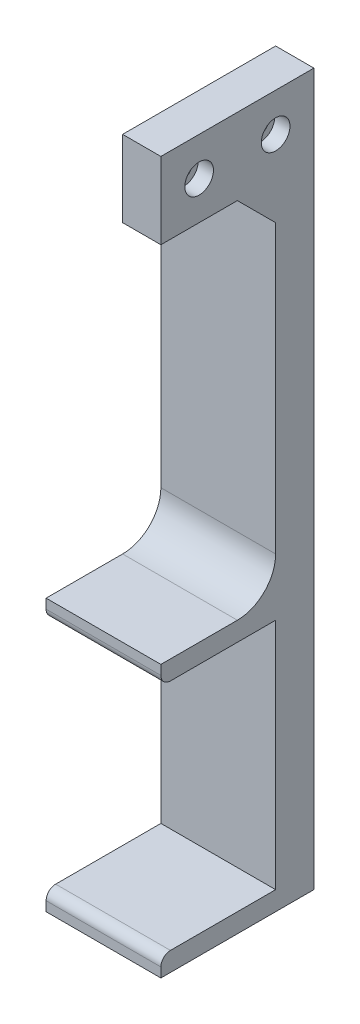
ISO-10303-21;
HEADER;
FILE_DESCRIPTION(('STEP AP214'),'2;1');
FILE_NAME('part.step','',(''),(''),'','','');
FILE_SCHEMA(('AUTOMOTIVE_DESIGN { 1 0 10303 214 1 1 1 1 }'));
ENDSEC;
DATA;
#1=APPLICATION_CONTEXT('core data for automotive mechanical design processes');
#2=APPLICATION_PROTOCOL_DEFINITION('international standard','automotive_design',2000,#1);
#3=PRODUCT_CONTEXT('',#1,'mechanical');
#4=PRODUCT('Part','Part','',(#3));
#5=PRODUCT_RELATED_PRODUCT_CATEGORY('part','',(#4));
#6=PRODUCT_DEFINITION_FORMATION('','',#4);
#7=PRODUCT_DEFINITION_CONTEXT('part definition',#1,'design');
#8=PRODUCT_DEFINITION('design','',#6,#7);
#9=PRODUCT_DEFINITION_SHAPE('','',#8);
#10=(LENGTH_UNIT() NAMED_UNIT(*) SI_UNIT(.MILLI.,.METRE.));
#11=(NAMED_UNIT(*) PLANE_ANGLE_UNIT() SI_UNIT($,.RADIAN.));
#12=(NAMED_UNIT(*) SI_UNIT($,.STERADIAN.) SOLID_ANGLE_UNIT());
#13=UNCERTAINTY_MEASURE_WITH_UNIT(LENGTH_MEASURE(1.E-05),#10,'distance_accuracy_value','');
#14=(GEOMETRIC_REPRESENTATION_CONTEXT(3) GLOBAL_UNCERTAINTY_ASSIGNED_CONTEXT((#13)) GLOBAL_UNIT_ASSIGNED_CONTEXT((#10,
#11,#12)) REPRESENTATION_CONTEXT('',''));
#15=CARTESIAN_POINT('',(0.,0.,0.));
#16=DIRECTION('',(0.,0.,1.));
#17=DIRECTION('',(1.,0.,0.));
#18=AXIS2_PLACEMENT_3D('',#15,#16,#17);
#19=CARTESIAN_POINT('',(18.2037007997491,150.330357142857,10.));
#20=DIRECTION('',(-1.,0.,0.));
#21=DIRECTION('',(0.,-1.,0.));
#22=AXIS2_PLACEMENT_3D('',#19,#20,#21);
#23=CYLINDRICAL_SURFACE('',#22,2.05);
#24=CARTESIAN_POINT('',(8.2037007997491,150.330357142857,10.));
#25=DIRECTION('',(-1.,0.,0.));
#26=DIRECTION('',(0.,-1.,0.));
#27=AXIS2_PLACEMENT_3D('',#24,#25,#26);
#28=CIRCLE('',#27,2.05);
#29=CARTESIAN_POINT('',(8.2037007997491,148.280357142857,10.));
#30=VERTEX_POINT('',#29);
#31=EDGE_CURVE('E339',#30,#30,#28,.T.);
#32=ORIENTED_EDGE('',*,*,#31,.T.);
#33=EDGE_LOOP('',(#32));
#34=FACE_BOUND('',#33,.T.);
#35=CARTESIAN_POINT('',(14.2037007997491,150.330357142857,10.));
#36=DIRECTION('',(1.,0.,0.));
#37=DIRECTION('',(0.,1.,0.));
#38=AXIS2_PLACEMENT_3D('',#35,#36,#37);
#39=CIRCLE('',#38,2.05);
#40=CARTESIAN_POINT('',(14.2037007997491,152.380357142857,10.));
#41=VERTEX_POINT('',#40);
#42=EDGE_CURVE('E43',#41,#41,#39,.F.);
#43=ORIENTED_EDGE('',*,*,#42,.F.);
#44=EDGE_LOOP('',(#43));
#45=FACE_BOUND('',#44,.T.);
#46=ADVANCED_FACE('F39',(#34,#45),#23,.F.);
#47=CARTESIAN_POINT('',(18.2037007997491,150.330357142857,30.));
#48=DIRECTION('',(-1.,0.,0.));
#49=DIRECTION('',(0.,-1.,0.));
#50=AXIS2_PLACEMENT_3D('',#47,#48,#49);
#51=CYLINDRICAL_SURFACE('',#50,2.05);
#52=CARTESIAN_POINT('',(8.2037007997491,150.330357142857,30.));
#53=DIRECTION('',(-1.,0.,0.));
#54=DIRECTION('',(0.,-1.,0.));
#55=AXIS2_PLACEMENT_3D('',#52,#53,#54);
#56=CIRCLE('',#55,2.05);
#57=CARTESIAN_POINT('',(8.2037007997491,148.280357142857,30.));
#58=VERTEX_POINT('',#57);
#59=EDGE_CURVE('E357',#58,#58,#56,.T.);
#60=ORIENTED_EDGE('',*,*,#59,.T.);
#61=EDGE_LOOP('',(#60));
#62=FACE_BOUND('',#61,.T.);
#63=CARTESIAN_POINT('',(14.2037007997491,150.330357142857,30.));
#64=DIRECTION('',(1.,0.,0.));
#65=DIRECTION('',(0.,1.,0.));
#66=AXIS2_PLACEMENT_3D('',#63,#64,#65);
#67=CIRCLE('',#66,2.05);
#68=CARTESIAN_POINT('',(14.2037007997491,152.380357142857,30.));
#69=VERTEX_POINT('',#68);
#70=EDGE_CURVE('E330',#69,#69,#67,.F.);
#71=ORIENTED_EDGE('',*,*,#70,.F.);
#72=EDGE_LOOP('',(#71));
#73=FACE_BOUND('',#72,.T.);
#74=ADVANCED_FACE('F432',(#62,#73),#51,.F.);
#75=CARTESIAN_POINT('',(0.,0.,10.));
#76=DIRECTION('',(0.,0.,1.));
#77=DIRECTION('',(1.,0.,0.));
#78=AXIS2_PLACEMENT_3D('',#75,#76,#77);
#79=PLANE('',#78);
#80=DIRECTION('',(0.,1.,0.));
#81=VECTOR('',#80,1.);
#82=CARTESIAN_POINT('',(18.2037007997491,160.330357142857,10.));
#83=LINE('',#82,#81);
#84=CARTESIAN_POINT('',(18.2037007997491,55.3303571428572,10.));
#85=VERTEX_POINT('',#84);
#86=CARTESIAN_POINT('',(18.2037007997491,130.330357142857,10.));
#87=VERTEX_POINT('',#86);
#88=EDGE_CURVE('E256',#85,#87,#83,.T.);
#89=ORIENTED_EDGE('',*,*,#88,.T.);
#90=DIRECTION('',(-1.,0.,0.));
#91=VECTOR('',#90,1.);
#92=CARTESIAN_POINT('',(1.2057980275635E-13,130.330357142857,10.));
#93=LINE('',#92,#91);
#94=CARTESIAN_POINT('',(-11.7962992002509,130.330357142857,10.));
#95=VERTEX_POINT('',#94);
#96=EDGE_CURVE('E63',#87,#95,#93,.T.);
#97=ORIENTED_EDGE('',*,*,#96,.T.);
#98=DIRECTION('',(0.,-1.,0.));
#99=VECTOR('',#98,1.);
#100=CARTESIAN_POINT('',(-11.7962992002509,160.330357142857,10.));
#101=LINE('',#100,#99);
#102=CARTESIAN_POINT('',(-11.7962992002509,55.3303571428572,10.));
#103=VERTEX_POINT('',#102);
#104=EDGE_CURVE('E253',#95,#103,#101,.T.);
#105=ORIENTED_EDGE('',*,*,#104,.T.);
#106=DIRECTION('',(-1.,0.,0.));
#107=VECTOR('',#106,1.);
#108=CARTESIAN_POINT('',(0.,55.3303571428571,10.));
#109=LINE('',#108,#107);
#110=EDGE_CURVE('E313',#103,#85,#109,.F.);
#111=ORIENTED_EDGE('',*,*,#110,.T.);
#112=EDGE_LOOP('',(#89,#97,#105,#111));
#113=FACE_BOUND('',#112,.T.);
#114=ADVANCED_FACE('F438',(#113),#79,.T.);
#115=CARTESIAN_POINT('',(18.2037007997491,-20.6696428571428,10.));
#116=VERTEX_POINT('',#115);
#117=CARTESIAN_POINT('',(18.2037007997491,40.3303571428571,10.));
#118=VERTEX_POINT('',#117);
#119=EDGE_CURVE('E258',#116,#118,#83,.T.);
#120=ORIENTED_EDGE('',*,*,#119,.T.);
#121=DIRECTION('',(1.,0.,0.));
#122=VECTOR('',#121,1.);
#123=CARTESIAN_POINT('',(-11.7962992002509,40.3303571428571,10.));
#124=LINE('',#123,#122);
#125=CARTESIAN_POINT('',(-11.7962992002509,40.3303571428571,10.));
#126=VERTEX_POINT('',#125);
#127=EDGE_CURVE('E198',#126,#118,#124,.T.);
#128=ORIENTED_EDGE('',*,*,#127,.F.);
#129=CARTESIAN_POINT('',(-11.7962992002509,-20.6696428571429,10.));
#130=VERTEX_POINT('',#129);
#131=EDGE_CURVE('E257',#126,#130,#101,.T.);
#132=ORIENTED_EDGE('',*,*,#131,.T.);
#133=DIRECTION('',(-1.,0.,0.));
#134=VECTOR('',#133,1.);
#135=CARTESIAN_POINT('',(-11.7962992002509,-20.6696428571429,10.));
#136=LINE('',#135,#134);
#137=EDGE_CURVE('E231',#116,#130,#136,.T.);
#138=ORIENTED_EDGE('',*,*,#137,.F.);
#139=EDGE_LOOP('',(#120,#128,#132,#138));
#140=FACE_BOUND('',#139,.T.);
#141=ADVANCED_FACE('F401',(#140),#79,.T.);
#142=CARTESIAN_POINT('',(-11.7962992002509,160.330357142857,10.));
#143=DIRECTION('',(1.,0.,0.));
#144=DIRECTION('',(0.,1.,0.));
#145=AXIS2_PLACEMENT_3D('',#142,#143,#144);
#146=PLANE('',#145);
#147=DIRECTION('',(0.,0.707106781186542,0.707106781186553));
#148=VECTOR('',#147,1.);
#149=CARTESIAN_POINT('',(-11.7962992002509,145.330357142857,25.));
#150=LINE('',#149,#148);
#151=CARTESIAN_POINT('',(-11.7962992002509,140.330357142857,20.0000000000001));
#152=VERTEX_POINT('',#151);
#153=EDGE_CURVE('E11',#95,#152,#150,.T.);
#154=ORIENTED_EDGE('',*,*,#153,.T.);
#155=DIRECTION('',(0.,0.,1.));
#156=VECTOR('',#155,1.);
#157=CARTESIAN_POINT('',(-11.7962992002509,140.330357142857,40.));
#158=LINE('',#157,#156);
#159=CARTESIAN_POINT('',(-11.7962992002509,140.330357142857,0.));
#160=VERTEX_POINT('',#159);
#161=EDGE_CURVE('E176',#160,#152,#158,.T.);
#162=ORIENTED_EDGE('',*,*,#161,.F.);
#163=DIRECTION('',(0.,-1.,0.));
#164=VECTOR('',#163,1.);
#165=CARTESIAN_POINT('',(-11.7962992002509,160.330357142857,0.));
#166=LINE('',#165,#164);
#167=CARTESIAN_POINT('',(-11.7962992002509,-25.6696428571429,0.));
#168=VERTEX_POINT('',#167);
#169=EDGE_CURVE('E252',#160,#168,#166,.T.);
#170=ORIENTED_EDGE('',*,*,#169,.T.);
#171=DIRECTION('',(0.,0.,-1.));
#172=VECTOR('',#171,1.);
#173=CARTESIAN_POINT('',(-11.7962992002509,-25.6696428571429,10.));
#174=LINE('',#173,#172);
#175=CARTESIAN_POINT('',(-11.7962992002509,-25.6696428571429,40.));
#176=VERTEX_POINT('',#175);
#177=EDGE_CURVE('E279',#176,#168,#174,.T.);
#178=ORIENTED_EDGE('',*,*,#177,.F.);
#179=DIRECTION('',(0.,-1.,0.));
#180=VECTOR('',#179,1.);
#181=CARTESIAN_POINT('',(-11.7962992002509,-25.6696428571429,40.));
#182=LINE('',#181,#180);
#183=CARTESIAN_POINT('',(-11.7962992002509,-23.1696428571429,40.));
#184=VERTEX_POINT('',#183);
#185=EDGE_CURVE('E232',#184,#176,#182,.T.);
#186=ORIENTED_EDGE('',*,*,#185,.F.);
#187=CARTESIAN_POINT('',(-11.7962992002509,-23.1696428571429,37.5));
#188=DIRECTION('',(1.,0.,0.));
#189=DIRECTION('',(0.,1.,0.));
#190=AXIS2_PLACEMENT_3D('',#187,#188,#189);
#191=CIRCLE('',#190,2.5);
#192=CARTESIAN_POINT('',(-11.7962992002509,-20.6696428571429,37.5));
#193=VERTEX_POINT('',#192);
#194=EDGE_CURVE('E290',#184,#193,#191,.F.);
#195=ORIENTED_EDGE('',*,*,#194,.T.);
#196=DIRECTION('',(0.,0.,-1.));
#197=VECTOR('',#196,1.);
#198=CARTESIAN_POINT('',(-11.7962992002509,-20.6696428571429,40.));
#199=LINE('',#198,#197);
#200=EDGE_CURVE('E243',#193,#130,#199,.T.);
#201=ORIENTED_EDGE('',*,*,#200,.T.);
#202=ORIENTED_EDGE('',*,*,#131,.F.);
#203=DIRECTION('',(0.,0.,-1.));
#204=VECTOR('',#203,1.);
#205=CARTESIAN_POINT('',(-11.7962992002509,40.3303571428571,40.));
#206=LINE('',#205,#204);
#207=CARTESIAN_POINT('',(-11.7962992002509,40.3303571428571,37.5));
#208=VERTEX_POINT('',#207);
#209=EDGE_CURVE('E228',#208,#126,#206,.T.);
#210=ORIENTED_EDGE('',*,*,#209,.F.);
#211=CARTESIAN_POINT('',(-11.7962992002509,42.8303571428571,37.5));
#212=DIRECTION('',(1.,0.,0.));
#213=DIRECTION('',(0.,1.,0.));
#214=AXIS2_PLACEMENT_3D('',#211,#212,#213);
#215=CIRCLE('',#214,2.5);
#216=CARTESIAN_POINT('',(-11.7962992002509,42.8303571428571,40.));
#217=VERTEX_POINT('',#216);
#218=EDGE_CURVE('E287',#208,#217,#215,.F.);
#219=ORIENTED_EDGE('',*,*,#218,.T.);
#220=DIRECTION('',(0.,-1.,0.));
#221=VECTOR('',#220,1.);
#222=CARTESIAN_POINT('',(-11.7962992002509,45.3303571428571,40.));
#223=LINE('',#222,#221);
#224=CARTESIAN_POINT('',(-11.7962992002509,45.3303571428571,40.));
#225=VERTEX_POINT('',#224);
#226=EDGE_CURVE('E204',#225,#217,#223,.T.);
#227=ORIENTED_EDGE('',*,*,#226,.F.);
#228=DIRECTION('',(0.,0.,-1.));
#229=VECTOR('',#228,1.);
#230=CARTESIAN_POINT('',(-11.7962992002509,45.3303571428571,40.));
#231=LINE('',#230,#229);
#232=CARTESIAN_POINT('',(-11.7962992002509,45.3303571428571,20.));
#233=VERTEX_POINT('',#232);
#234=EDGE_CURVE('E214',#225,#233,#231,.T.);
#235=ORIENTED_EDGE('',*,*,#234,.T.);
#236=CARTESIAN_POINT('',(-11.7962992002509,55.3303571428571,20.));
#237=DIRECTION('',(1.,0.,0.));
#238=DIRECTION('',(0.,1.,0.));
#239=AXIS2_PLACEMENT_3D('',#236,#237,#238);
#240=CIRCLE('',#239,10.);
#241=EDGE_CURVE('E316',#233,#103,#240,.T.);
#242=ORIENTED_EDGE('',*,*,#241,.T.);
#243=ORIENTED_EDGE('',*,*,#104,.F.);
#244=EDGE_LOOP('',(#154,#162,#170,#178,#186,#195,#201,#202,#210,#219,#227,#235,#242,#243));
#245=FACE_BOUND('',#244,.T.);
#246=ADVANCED_FACE('F418',(#245),#146,.F.);
#247=CARTESIAN_POINT('',(-11.7962992002509,-25.6696428571429,10.));
#248=DIRECTION('',(0.,1.,0.));
#249=DIRECTION('',(0.,0.,1.));
#250=AXIS2_PLACEMENT_3D('',#247,#248,#249);
#251=PLANE('',#250);
#252=DIRECTION('',(1.,0.,0.));
#253=VECTOR('',#252,1.);
#254=CARTESIAN_POINT('',(-11.7962992002509,-25.6696428571429,0.));
#255=LINE('',#254,#253);
#256=CARTESIAN_POINT('',(18.2037007997491,-25.6696428571429,0.));
#257=VERTEX_POINT('',#256);
#258=EDGE_CURVE('E265',#168,#257,#255,.T.);
#259=ORIENTED_EDGE('',*,*,#258,.T.);
#260=DIRECTION('',(0.,0.,-1.));
#261=VECTOR('',#260,1.);
#262=CARTESIAN_POINT('',(18.2037007997491,-25.6696428571429,10.));
#263=LINE('',#262,#261);
#264=CARTESIAN_POINT('',(18.2037007997491,-25.6696428571429,40.));
#265=VERTEX_POINT('',#264);
#266=EDGE_CURVE('E275',#265,#257,#263,.T.);
#267=ORIENTED_EDGE('',*,*,#266,.F.);
#268=DIRECTION('',(1.,0.,0.));
#269=VECTOR('',#268,1.);
#270=CARTESIAN_POINT('',(-11.7962992002509,-25.6696428571429,40.));
#271=LINE('',#270,#269);
#272=EDGE_CURVE('E235',#176,#265,#271,.T.);
#273=ORIENTED_EDGE('',*,*,#272,.F.);
#274=ORIENTED_EDGE('',*,*,#177,.T.);
#275=EDGE_LOOP('',(#259,#267,#273,#274));
#276=FACE_BOUND('',#275,.T.);
#277=ADVANCED_FACE('F421',(#276),#251,.F.);
#278=CARTESIAN_POINT('',(18.2037007997491,160.330357142857,10.));
#279=DIRECTION('',(-1.,0.,0.));
#280=DIRECTION('',(0.,-1.,0.));
#281=AXIS2_PLACEMENT_3D('',#278,#279,#280);
#282=PLANE('',#281);
#283=CARTESIAN_POINT('',(18.2037007997491,150.330357142857,30.));
#284=DIRECTION('',(1.,0.,0.));
#285=DIRECTION('',(0.,1.,0.));
#286=AXIS2_PLACEMENT_3D('',#283,#284,#285);
#287=CIRCLE('',#286,3.75);
#288=CARTESIAN_POINT('',(18.2037007997491,154.080357142857,30.));
#289=VERTEX_POINT('',#288);
#290=EDGE_CURVE('E341',#289,#289,#287,.T.);
#291=ORIENTED_EDGE('',*,*,#290,.F.);
#292=EDGE_LOOP('',(#291));
#293=FACE_BOUND('',#292,.T.);
#294=CARTESIAN_POINT('',(18.2037007997491,150.330357142857,10.));
#295=DIRECTION('',(1.,0.,0.));
#296=DIRECTION('',(0.,1.,0.));
#297=AXIS2_PLACEMENT_3D('',#294,#295,#296);
#298=CIRCLE('',#297,3.75);
#299=CARTESIAN_POINT('',(18.2037007997491,154.080357142857,10.));
#300=VERTEX_POINT('',#299);
#301=EDGE_CURVE('E353',#300,#300,#298,.T.);
#302=ORIENTED_EDGE('',*,*,#301,.F.);
#303=EDGE_LOOP('',(#302));
#304=FACE_BOUND('',#303,.T.);
#305=DIRECTION('',(0.,0.,-1.));
#306=VECTOR('',#305,1.);
#307=CARTESIAN_POINT('',(18.2037007997491,-20.6696428571429,40.));
#308=LINE('',#307,#306);
#309=CARTESIAN_POINT('',(18.2037007997491,-20.6696428571429,37.5));
#310=VERTEX_POINT('',#309);
#311=EDGE_CURVE('E249',#310,#116,#308,.T.);
#312=ORIENTED_EDGE('',*,*,#311,.F.);
#313=CARTESIAN_POINT('',(18.2037007997491,-23.1696428571429,37.5));
#314=DIRECTION('',(-1.,0.,0.));
#315=DIRECTION('',(0.,-1.,0.));
#316=AXIS2_PLACEMENT_3D('',#313,#314,#315);
#317=CIRCLE('',#316,2.5);
#318=CARTESIAN_POINT('',(18.2037007997491,-23.1696428571429,40.));
#319=VERTEX_POINT('',#318);
#320=EDGE_CURVE('E299',#310,#319,#317,.F.);
#321=ORIENTED_EDGE('',*,*,#320,.T.);
#322=DIRECTION('',(0.,1.,0.));
#323=VECTOR('',#322,1.);
#324=CARTESIAN_POINT('',(18.2037007997491,-25.6696428571429,40.));
#325=LINE('',#324,#323);
#326=EDGE_CURVE('E239',#265,#319,#325,.T.);
#327=ORIENTED_EDGE('',*,*,#326,.F.);
#328=ORIENTED_EDGE('',*,*,#266,.T.);
#329=DIRECTION('',(0.,1.,0.));
#330=VECTOR('',#329,1.);
#331=CARTESIAN_POINT('',(18.2037007997491,160.330357142857,0.));
#332=LINE('',#331,#330);
#333=CARTESIAN_POINT('',(18.2037007997491,160.330357142857,0.));
#334=VERTEX_POINT('',#333);
#335=EDGE_CURVE('E268',#257,#334,#332,.T.);
#336=ORIENTED_EDGE('',*,*,#335,.T.);
#337=DIRECTION('',(0.,0.,-1.));
#338=VECTOR('',#337,1.);
#339=CARTESIAN_POINT('',(18.2037007997491,160.330357142857,10.));
#340=LINE('',#339,#338);
#341=CARTESIAN_POINT('',(18.2037007997491,160.330357142857,40.));
#342=VERTEX_POINT('',#341);
#343=EDGE_CURVE('E262',#342,#334,#340,.T.);
#344=ORIENTED_EDGE('',*,*,#343,.F.);
#345=DIRECTION('',(0.,1.,0.));
#346=VECTOR('',#345,1.);
#347=CARTESIAN_POINT('',(18.2037007997491,160.330357142857,40.));
#348=LINE('',#347,#346);
#349=CARTESIAN_POINT('',(18.2037007997491,140.330357142857,40.));
#350=VERTEX_POINT('',#349);
#351=EDGE_CURVE('E192',#350,#342,#348,.T.);
#352=ORIENTED_EDGE('',*,*,#351,.F.);
#353=DIRECTION('',(0.,0.,-1.));
#354=VECTOR('',#353,1.);
#355=CARTESIAN_POINT('',(18.2037007997491,140.330357142857,40.));
#356=LINE('',#355,#354);
#357=CARTESIAN_POINT('',(18.2037007997491,140.330357142857,20.0000000000001));
#358=VERTEX_POINT('',#357);
#359=EDGE_CURVE('E194',#350,#358,#356,.T.);
#360=ORIENTED_EDGE('',*,*,#359,.T.);
#361=DIRECTION('',(0.,-0.707106781186542,-0.707106781186553));
#362=VECTOR('',#361,1.);
#363=CARTESIAN_POINT('',(18.2037007997491,145.330357142857,25.));
#364=LINE('',#363,#362);
#365=EDGE_CURVE('E49',#358,#87,#364,.T.);
#366=ORIENTED_EDGE('',*,*,#365,.T.);
#367=ORIENTED_EDGE('',*,*,#88,.F.);
#368=CARTESIAN_POINT('',(18.2037007997491,55.3303571428571,20.));
#369=DIRECTION('',(-1.,0.,0.));
#370=DIRECTION('',(0.,-1.,0.));
#371=AXIS2_PLACEMENT_3D('',#368,#369,#370);
#372=CIRCLE('',#371,10.);
#373=CARTESIAN_POINT('',(18.2037007997491,45.3303571428571,20.));
#374=VERTEX_POINT('',#373);
#375=EDGE_CURVE('E320',#85,#374,#372,.T.);
#376=ORIENTED_EDGE('',*,*,#375,.T.);
#377=DIRECTION('',(0.,0.,-1.));
#378=VECTOR('',#377,1.);
#379=CARTESIAN_POINT('',(18.2037007997491,45.3303571428571,40.));
#380=LINE('',#379,#378);
#381=CARTESIAN_POINT('',(18.2037007997491,45.3303571428571,40.));
#382=VERTEX_POINT('',#381);
#383=EDGE_CURVE('E221',#382,#374,#380,.T.);
#384=ORIENTED_EDGE('',*,*,#383,.F.);
#385=DIRECTION('',(0.,1.,0.));
#386=VECTOR('',#385,1.);
#387=CARTESIAN_POINT('',(18.2037007997491,45.3303571428571,40.));
#388=LINE('',#387,#386);
#389=CARTESIAN_POINT('',(18.2037007997491,42.8303571428571,40.));
#390=VERTEX_POINT('',#389);
#391=EDGE_CURVE('E208',#390,#382,#388,.T.);
#392=ORIENTED_EDGE('',*,*,#391,.F.);
#393=CARTESIAN_POINT('',(18.2037007997491,42.8303571428571,37.5));
#394=DIRECTION('',(-1.,0.,0.));
#395=DIRECTION('',(0.,-1.,0.));
#396=AXIS2_PLACEMENT_3D('',#393,#394,#395);
#397=CIRCLE('',#396,2.5);
#398=CARTESIAN_POINT('',(18.2037007997491,40.3303571428571,37.5));
#399=VERTEX_POINT('',#398);
#400=EDGE_CURVE('E296',#390,#399,#397,.F.);
#401=ORIENTED_EDGE('',*,*,#400,.T.);
#402=DIRECTION('',(0.,0.,-1.));
#403=VECTOR('',#402,1.);
#404=CARTESIAN_POINT('',(18.2037007997491,40.3303571428571,40.));
#405=LINE('',#404,#403);
#406=EDGE_CURVE('E225',#399,#118,#405,.T.);
#407=ORIENTED_EDGE('',*,*,#406,.T.);
#408=ORIENTED_EDGE('',*,*,#119,.F.);
#409=EDGE_LOOP('',(#312,#321,#327,#328,#336,#344,#352,#360,#366,#367,#376,#384,#392,#401,#407,#408));
#410=FACE_BOUND('',#409,.T.);
#411=ADVANCED_FACE('F379',(#293,#304,#410),#282,.F.);
#412=CARTESIAN_POINT('',(-11.7962992002509,160.330357142857,10.));
#413=DIRECTION('',(0.,-1.,0.));
#414=DIRECTION('',(0.,0.,-1.));
#415=AXIS2_PLACEMENT_3D('',#412,#413,#414);
#416=PLANE('',#415);
#417=DIRECTION('',(-1.,0.,0.));
#418=VECTOR('',#417,1.);
#419=CARTESIAN_POINT('',(-11.7962992002509,160.330357142857,0.));
#420=LINE('',#419,#418);
#421=CARTESIAN_POINT('',(8.20370079974908,160.330357142857,0.));
#422=VERTEX_POINT('',#421);
#423=EDGE_CURVE('E185',#334,#422,#420,.T.);
#424=ORIENTED_EDGE('',*,*,#423,.T.);
#425=DIRECTION('',(0.,0.,-1.));
#426=VECTOR('',#425,1.);
#427=CARTESIAN_POINT('',(8.20370079974908,160.330357142857,40.));
#428=LINE('',#427,#426);
#429=CARTESIAN_POINT('',(8.20370079974908,160.330357142857,40.));
#430=VERTEX_POINT('',#429);
#431=EDGE_CURVE('E167',#430,#422,#428,.T.);
#432=ORIENTED_EDGE('',*,*,#431,.F.);
#433=DIRECTION('',(-1.,0.,0.));
#434=VECTOR('',#433,1.);
#435=CARTESIAN_POINT('',(-11.7962992002509,160.330357142857,40.));
#436=LINE('',#435,#434);
#437=EDGE_CURVE('E183',#342,#430,#436,.T.);
#438=ORIENTED_EDGE('',*,*,#437,.F.);
#439=ORIENTED_EDGE('',*,*,#343,.T.);
#440=EDGE_LOOP('',(#424,#432,#438,#439));
#441=FACE_BOUND('',#440,.T.);
#442=ADVANCED_FACE('F181',(#441),#416,.F.);
#443=CARTESIAN_POINT('',(0.,0.,0.));
#444=DIRECTION('',(0.,0.,1.));
#445=DIRECTION('',(1.,0.,0.));
#446=AXIS2_PLACEMENT_3D('',#443,#444,#445);
#447=PLANE('',#446);
#448=ORIENTED_EDGE('',*,*,#169,.F.);
#449=DIRECTION('',(-1.,0.,0.));
#450=VECTOR('',#449,1.);
#451=CARTESIAN_POINT('',(8.20370079974909,140.330357142857,0.));
#452=LINE('',#451,#450);
#453=CARTESIAN_POINT('',(8.20370079974909,140.330357142857,0.));
#454=VERTEX_POINT('',#453);
#455=EDGE_CURVE('E369',#454,#160,#452,.T.);
#456=ORIENTED_EDGE('',*,*,#455,.F.);
#457=DIRECTION('',(0.,-1.,0.));
#458=VECTOR('',#457,1.);
#459=CARTESIAN_POINT('',(8.20370079974908,160.330357142857,0.));
#460=LINE('',#459,#458);
#461=EDGE_CURVE('E187',#422,#454,#460,.T.);
#462=ORIENTED_EDGE('',*,*,#461,.F.);
#463=ORIENTED_EDGE('',*,*,#423,.F.);
#464=ORIENTED_EDGE('',*,*,#335,.F.);
#465=ORIENTED_EDGE('',*,*,#258,.F.);
#466=EDGE_LOOP('',(#448,#456,#462,#463,#464,#465));
#467=FACE_BOUND('',#466,.T.);
#468=ADVANCED_FACE('F383',(#467),#447,.F.);
#469=CARTESIAN_POINT('',(-11.7962992002509,-20.6696428571429,40.));
#470=DIRECTION('',(0.,-1.,0.));
#471=DIRECTION('',(0.,0.,-1.));
#472=AXIS2_PLACEMENT_3D('',#469,#470,#471);
#473=PLANE('',#472);
#474=ORIENTED_EDGE('',*,*,#200,.F.);
#475=DIRECTION('',(-1.,0.,0.));
#476=VECTOR('',#475,1.);
#477=CARTESIAN_POINT('',(-11.7962992002509,-20.6696428571429,37.5));
#478=LINE('',#477,#476);
#479=EDGE_CURVE('E293',#193,#310,#478,.F.);
#480=ORIENTED_EDGE('',*,*,#479,.T.);
#481=ORIENTED_EDGE('',*,*,#311,.T.);
#482=ORIENTED_EDGE('',*,*,#137,.T.);
#483=EDGE_LOOP('',(#474,#480,#481,#482));
#484=FACE_BOUND('',#483,.T.);
#485=ADVANCED_FACE('F407',(#484),#473,.F.);
#486=CARTESIAN_POINT('',(0.,0.,40.));
#487=DIRECTION('',(0.,0.,-1.));
#488=DIRECTION('',(-1.,0.,0.));
#489=AXIS2_PLACEMENT_3D('',#486,#487,#488);
#490=PLANE('',#489);
#491=ORIENTED_EDGE('',*,*,#326,.T.);
#492=DIRECTION('',(-1.,0.,0.));
#493=VECTOR('',#492,1.);
#494=CARTESIAN_POINT('',(0.,-23.1696428571429,40.));
#495=LINE('',#494,#493);
#496=EDGE_CURVE('E283',#319,#184,#495,.T.);
#497=ORIENTED_EDGE('',*,*,#496,.T.);
#498=ORIENTED_EDGE('',*,*,#185,.T.);
#499=ORIENTED_EDGE('',*,*,#272,.T.);
#500=EDGE_LOOP('',(#491,#497,#498,#499));
#501=FACE_BOUND('',#500,.T.);
#502=ADVANCED_FACE('F416',(#501),#490,.F.);
#503=CARTESIAN_POINT('',(-11.7962992002509,40.3303571428571,40.));
#504=DIRECTION('',(0.,1.,0.));
#505=DIRECTION('',(0.,0.,1.));
#506=AXIS2_PLACEMENT_3D('',#503,#504,#505);
#507=PLANE('',#506);
#508=ORIENTED_EDGE('',*,*,#406,.F.);
#509=DIRECTION('',(1.,0.,0.));
#510=VECTOR('',#509,1.);
#511=CARTESIAN_POINT('',(-11.7962992002509,40.3303571428571,37.5));
#512=LINE('',#511,#510);
#513=EDGE_CURVE('E306',#399,#208,#512,.F.);
#514=ORIENTED_EDGE('',*,*,#513,.T.);
#515=ORIENTED_EDGE('',*,*,#209,.T.);
#516=ORIENTED_EDGE('',*,*,#127,.T.);
#517=EDGE_LOOP('',(#508,#514,#515,#516));
#518=FACE_BOUND('',#517,.T.);
#519=ADVANCED_FACE('F461',(#518),#507,.F.);
#520=CARTESIAN_POINT('',(-11.7962992002509,45.3303571428571,40.));
#521=DIRECTION('',(0.,-1.,0.));
#522=DIRECTION('',(0.,0.,-1.));
#523=AXIS2_PLACEMENT_3D('',#520,#521,#522);
#524=PLANE('',#523);
#525=ORIENTED_EDGE('',*,*,#383,.T.);
#526=DIRECTION('',(-1.,0.,0.));
#527=VECTOR('',#526,1.);
#528=CARTESIAN_POINT('',(-11.7962992002509,45.3303571428571,20.));
#529=LINE('',#528,#527);
#530=EDGE_CURVE('E309',#374,#233,#529,.T.);
#531=ORIENTED_EDGE('',*,*,#530,.T.);
#532=ORIENTED_EDGE('',*,*,#234,.F.);
#533=DIRECTION('',(-1.,0.,0.));
#534=VECTOR('',#533,1.);
#535=CARTESIAN_POINT('',(-11.7962992002509,45.3303571428571,40.));
#536=LINE('',#535,#534);
#537=EDGE_CURVE('E211',#382,#225,#536,.T.);
#538=ORIENTED_EDGE('',*,*,#537,.F.);
#539=EDGE_LOOP('',(#525,#531,#532,#538));
#540=FACE_BOUND('',#539,.T.);
#541=ADVANCED_FACE('F457',(#540),#524,.F.);
#542=CARTESIAN_POINT('',(0.,0.,40.));
#543=DIRECTION('',(0.,0.,1.));
#544=DIRECTION('',(1.,0.,0.));
#545=AXIS2_PLACEMENT_3D('',#542,#543,#544);
#546=PLANE('',#545);
#547=ORIENTED_EDGE('',*,*,#226,.T.);
#548=DIRECTION('',(1.,0.,0.));
#549=VECTOR('',#548,1.);
#550=CARTESIAN_POINT('',(18.2037007997491,42.8303571428571,40.));
#551=LINE('',#550,#549);
#552=EDGE_CURVE('E302',#217,#390,#551,.T.);
#553=ORIENTED_EDGE('',*,*,#552,.T.);
#554=ORIENTED_EDGE('',*,*,#391,.T.);
#555=ORIENTED_EDGE('',*,*,#537,.T.);
#556=EDGE_LOOP('',(#547,#553,#554,#555));
#557=FACE_BOUND('',#556,.T.);
#558=ADVANCED_FACE('F454',(#557),#546,.T.);
#559=CARTESIAN_POINT('',(-11.7962992002509,140.330357142857,40.));
#560=DIRECTION('',(0.,1.,0.));
#561=DIRECTION('',(-1.,0.,0.));
#562=AXIS2_PLACEMENT_3D('',#559,#560,#561);
#563=PLANE('',#562);
#564=DIRECTION('',(1.,0.,0.));
#565=VECTOR('',#564,1.);
#566=CARTESIAN_POINT('',(-11.7962992002509,140.330357142857,40.));
#567=LINE('',#566,#565);
#568=CARTESIAN_POINT('',(8.20370079974909,140.330357142857,40.));
#569=VERTEX_POINT('',#568);
#570=EDGE_CURVE('E200',#569,#350,#567,.T.);
#571=ORIENTED_EDGE('',*,*,#570,.F.);
#572=DIRECTION('',(0.,0.,1.));
#573=VECTOR('',#572,1.);
#574=CARTESIAN_POINT('',(8.20370079974909,140.330357142857,40.));
#575=LINE('',#574,#573);
#576=CARTESIAN_POINT('',(8.20370079974909,140.330357142857,20.0000000000001));
#577=VERTEX_POINT('',#576);
#578=EDGE_CURVE('E171',#577,#569,#575,.T.);
#579=ORIENTED_EDGE('',*,*,#578,.F.);
#580=DIRECTION('',(1.,0.,0.));
#581=VECTOR('',#580,1.);
#582=CARTESIAN_POINT('',(-11.7962992002509,140.330357142857,20.0000000000001));
#583=LINE('',#582,#581);
#584=EDGE_CURVE('E323',#577,#358,#583,.T.);
#585=ORIENTED_EDGE('',*,*,#584,.T.);
#586=ORIENTED_EDGE('',*,*,#359,.F.);
#587=EDGE_LOOP('',(#571,#579,#585,#586));
#588=FACE_BOUND('',#587,.T.);
#589=ADVANCED_FACE('F376',(#588),#563,.F.);
#590=CARTESIAN_POINT('',(0.,0.,40.));
#591=DIRECTION('',(0.,0.,1.));
#592=DIRECTION('',(1.,0.,0.));
#593=AXIS2_PLACEMENT_3D('',#590,#591,#592);
#594=PLANE('',#593);
#595=DIRECTION('',(0.,1.,0.));
#596=VECTOR('',#595,1.);
#597=CARTESIAN_POINT('',(8.20370079974908,160.330357142857,40.));
#598=LINE('',#597,#596);
#599=EDGE_CURVE('E164',#569,#430,#598,.T.);
#600=ORIENTED_EDGE('',*,*,#599,.F.);
#601=ORIENTED_EDGE('',*,*,#570,.T.);
#602=ORIENTED_EDGE('',*,*,#351,.T.);
#603=ORIENTED_EDGE('',*,*,#437,.T.);
#604=EDGE_LOOP('',(#600,#601,#602,#603));
#605=FACE_BOUND('',#604,.T.);
#606=ADVANCED_FACE('F190',(#605),#594,.T.);
#607=CARTESIAN_POINT('',(0.,-23.1696428571429,37.5));
#608=DIRECTION('',(-1.,0.,0.));
#609=DIRECTION('',(0.,0.,1.));
#610=AXIS2_PLACEMENT_3D('',#607,#608,#609);
#611=CYLINDRICAL_SURFACE('',#610,2.5);
#612=ORIENTED_EDGE('',*,*,#320,.F.);
#613=ORIENTED_EDGE('',*,*,#479,.F.);
#614=ORIENTED_EDGE('',*,*,#194,.F.);
#615=ORIENTED_EDGE('',*,*,#496,.F.);
#616=EDGE_LOOP('',(#612,#613,#614,#615));
#617=FACE_BOUND('',#616,.T.);
#618=ADVANCED_FACE('F413',(#617),#611,.T.);
#619=CARTESIAN_POINT('',(0.,42.8303571428571,37.5));
#620=DIRECTION('',(-1.,0.,0.));
#621=DIRECTION('',(0.,0.,1.));
#622=AXIS2_PLACEMENT_3D('',#619,#620,#621);
#623=CYLINDRICAL_SURFACE('',#622,2.5);
#624=ORIENTED_EDGE('',*,*,#218,.F.);
#625=ORIENTED_EDGE('',*,*,#513,.F.);
#626=ORIENTED_EDGE('',*,*,#400,.F.);
#627=ORIENTED_EDGE('',*,*,#552,.F.);
#628=EDGE_LOOP('',(#624,#625,#626,#627));
#629=FACE_BOUND('',#628,.T.);
#630=ADVANCED_FACE('F521',(#629),#623,.T.);
#631=CARTESIAN_POINT('',(-11.7962992002509,55.3303571428571,20.));
#632=DIRECTION('',(-1.,0.,0.));
#633=DIRECTION('',(0.,0.,1.));
#634=AXIS2_PLACEMENT_3D('',#631,#632,#633);
#635=CYLINDRICAL_SURFACE('',#634,10.);
#636=ORIENTED_EDGE('',*,*,#375,.F.);
#637=ORIENTED_EDGE('',*,*,#110,.F.);
#638=ORIENTED_EDGE('',*,*,#241,.F.);
#639=ORIENTED_EDGE('',*,*,#530,.F.);
#640=EDGE_LOOP('',(#636,#637,#638,#639));
#641=FACE_BOUND('',#640,.T.);
#642=ADVANCED_FACE('F527',(#641),#635,.F.);
#643=CARTESIAN_POINT('',(-11.7962992002509,140.330357142857,20.0000000000001));
#644=DIRECTION('',(0.,0.707106781186553,-0.707106781186542));
#645=DIRECTION('',(1.,0.,0.));
#646=AXIS2_PLACEMENT_3D('',#643,#644,#645);
#647=PLANE('',#646);
#648=ORIENTED_EDGE('',*,*,#153,.F.);
#649=ORIENTED_EDGE('',*,*,#96,.F.);
#650=ORIENTED_EDGE('',*,*,#365,.F.);
#651=ORIENTED_EDGE('',*,*,#584,.F.);
#652=EDGE_CURVE('E324',#152,#577,#583,.T.);
#653=ORIENTED_EDGE('',*,*,#652,.F.);
#654=EDGE_LOOP('',(#648,#649,#650,#651,#653));
#655=FACE_BOUND('',#654,.T.);
#656=ADVANCED_FACE('F41',(#655),#647,.F.);
#657=CARTESIAN_POINT('',(8.20370079974909,140.330357142857,40.));
#658=DIRECTION('',(0.,-1.,0.));
#659=DIRECTION('',(1.,0.,0.));
#660=AXIS2_PLACEMENT_3D('',#657,#658,#659);
#661=PLANE('',#660);
#662=EDGE_CURVE('E366',#454,#577,#575,.T.);
#663=ORIENTED_EDGE('',*,*,#662,.F.);
#664=ORIENTED_EDGE('',*,*,#455,.T.);
#665=ORIENTED_EDGE('',*,*,#161,.T.);
#666=ORIENTED_EDGE('',*,*,#652,.T.);
#667=EDGE_LOOP('',(#663,#664,#665,#666));
#668=FACE_BOUND('',#667,.T.);
#669=ADVANCED_FACE('F388',(#668),#661,.F.);
#670=CARTESIAN_POINT('',(8.20370079974911,0.,0.));
#671=DIRECTION('',(1.,0.,0.));
#672=DIRECTION('',(0.,1.,0.));
#673=AXIS2_PLACEMENT_3D('',#670,#671,#672);
#674=PLANE('',#673);
#675=ORIENTED_EDGE('',*,*,#59,.F.);
#676=EDGE_LOOP('',(#675));
#677=FACE_BOUND('',#676,.T.);
#678=ORIENTED_EDGE('',*,*,#31,.F.);
#679=EDGE_LOOP('',(#678));
#680=FACE_BOUND('',#679,.T.);
#681=ORIENTED_EDGE('',*,*,#599,.T.);
#682=ORIENTED_EDGE('',*,*,#431,.T.);
#683=ORIENTED_EDGE('',*,*,#461,.T.);
#684=ORIENTED_EDGE('',*,*,#662,.T.);
#685=ORIENTED_EDGE('',*,*,#578,.T.);
#686=EDGE_LOOP('',(#681,#682,#683,#684,#685));
#687=FACE_BOUND('',#686,.T.);
#688=ADVANCED_FACE('F166',(#677,#680,#687),#674,.F.);
#689=CARTESIAN_POINT('',(14.2037007997491,150.330357142857,30.));
#690=DIRECTION('',(1.,0.,0.));
#691=DIRECTION('',(0.,1.,0.));
#692=AXIS2_PLACEMENT_3D('',#689,#690,#691);
#693=PLANE('',#692);
#694=CARTESIAN_POINT('',(14.2037007997491,150.330357142857,30.));
#695=DIRECTION('',(1.,0.,0.));
#696=DIRECTION('',(0.,1.,0.));
#697=AXIS2_PLACEMENT_3D('',#694,#695,#696);
#698=CIRCLE('',#697,3.75);
#699=CARTESIAN_POINT('',(14.2037007997491,154.080357142857,30.));
#700=VERTEX_POINT('',#699);
#701=EDGE_CURVE('E333',#700,#700,#698,.T.);
#702=ORIENTED_EDGE('',*,*,#701,.T.);
#703=EDGE_LOOP('',(#702));
#704=FACE_BOUND('',#703,.T.);
#705=ORIENTED_EDGE('',*,*,#70,.T.);
#706=EDGE_LOOP('',(#705));
#707=FACE_BOUND('',#706,.T.);
#708=ADVANCED_FACE('F446',(#704,#707),#693,.T.);
#709=CARTESIAN_POINT('',(14.2037007997491,150.330357142857,30.));
#710=DIRECTION('',(1.,0.,0.));
#711=DIRECTION('',(0.,1.,0.));
#712=AXIS2_PLACEMENT_3D('',#709,#710,#711);
#713=CYLINDRICAL_SURFACE('',#712,3.75);
#714=ORIENTED_EDGE('',*,*,#701,.F.);
#715=EDGE_LOOP('',(#714));
#716=FACE_BOUND('',#715,.T.);
#717=ORIENTED_EDGE('',*,*,#290,.T.);
#718=EDGE_LOOP('',(#717));
#719=FACE_BOUND('',#718,.T.);
#720=ADVANCED_FACE('F553',(#716,#719),#713,.F.);
#721=CARTESIAN_POINT('',(14.2037007997491,150.330357142857,10.));
#722=DIRECTION('',(1.,0.,0.));
#723=DIRECTION('',(0.,1.,0.));
#724=AXIS2_PLACEMENT_3D('',#721,#722,#723);
#725=PLANE('',#724);
#726=CARTESIAN_POINT('',(14.2037007997491,150.330357142857,10.));
#727=DIRECTION('',(1.,0.,0.));
#728=DIRECTION('',(0.,1.,0.));
#729=AXIS2_PLACEMENT_3D('',#726,#727,#728);
#730=CIRCLE('',#729,3.75);
#731=CARTESIAN_POINT('',(14.2037007997491,154.080357142857,10.));
#732=VERTEX_POINT('',#731);
#733=EDGE_CURVE('E347',#732,#732,#730,.T.);
#734=ORIENTED_EDGE('',*,*,#733,.T.);
#735=EDGE_LOOP('',(#734));
#736=FACE_BOUND('',#735,.T.);
#737=ORIENTED_EDGE('',*,*,#42,.T.);
#738=EDGE_LOOP('',(#737));
#739=FACE_BOUND('',#738,.T.);
#740=ADVANCED_FACE('F560',(#736,#739),#725,.T.);
#741=CARTESIAN_POINT('',(14.2037007997491,150.330357142857,10.));
#742=DIRECTION('',(1.,0.,0.));
#743=DIRECTION('',(0.,1.,0.));
#744=AXIS2_PLACEMENT_3D('',#741,#742,#743);
#745=CYLINDRICAL_SURFACE('',#744,3.75);
#746=ORIENTED_EDGE('',*,*,#733,.F.);
#747=EDGE_LOOP('',(#746));
#748=FACE_BOUND('',#747,.T.);
#749=ORIENTED_EDGE('',*,*,#301,.T.);
#750=EDGE_LOOP('',(#749));
#751=FACE_BOUND('',#750,.T.);
#752=ADVANCED_FACE('F568',(#748,#751),#745,.F.);
#753=CLOSED_SHELL('',(#46,#74,#114,#141,#246,#277,#411,#442,#468,#485,#502,#519,#541,#558,#589,
#606,#618,#630,#642,#656,#669,#688,#708,#720,#740,#752));
#754=MANIFOLD_SOLID_BREP('B2',#753);
#755=ADVANCED_BREP_SHAPE_REPRESENTATION('',(#18,#754),#14);
#756=SHAPE_DEFINITION_REPRESENTATION(#9,#755);
ENDSEC;
END-ISO-10303-21;
